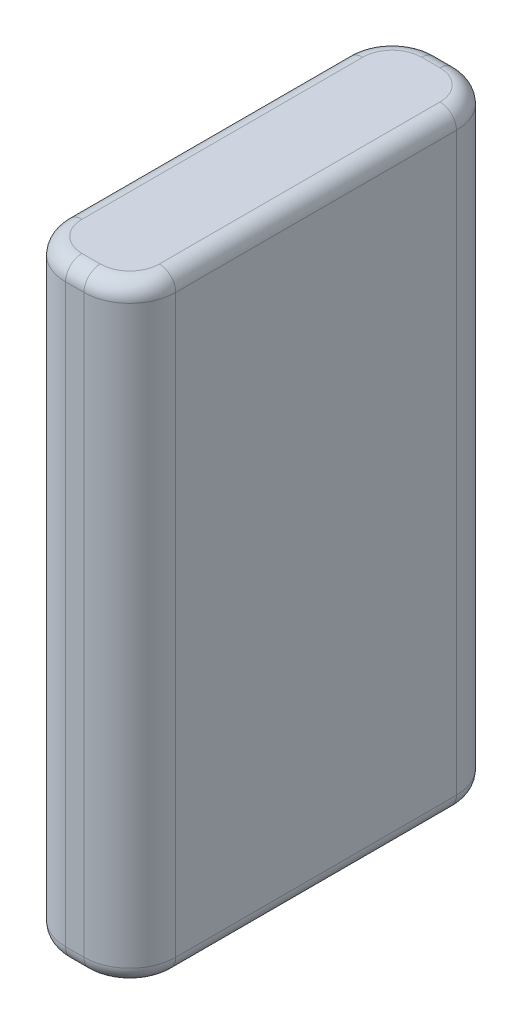
ISO-10303-21;
HEADER;
FILE_DESCRIPTION(('STEP AP214'),'2;1');
FILE_NAME('part.step','',(''),(''),'','','');
FILE_SCHEMA(('AUTOMOTIVE_DESIGN { 1 0 10303 214 1 1 1 1 }'));
ENDSEC;
DATA;
#1=APPLICATION_CONTEXT('core data for automotive mechanical design processes');
#2=APPLICATION_PROTOCOL_DEFINITION('international standard','automotive_design',2000,#1);
#3=PRODUCT_CONTEXT('',#1,'mechanical');
#4=PRODUCT('Part','Part','',(#3));
#5=PRODUCT_RELATED_PRODUCT_CATEGORY('part','',(#4));
#6=PRODUCT_DEFINITION_FORMATION('','',#4);
#7=PRODUCT_DEFINITION_CONTEXT('part definition',#1,'design');
#8=PRODUCT_DEFINITION('design','',#6,#7);
#9=PRODUCT_DEFINITION_SHAPE('','',#8);
#10=(LENGTH_UNIT() NAMED_UNIT(*) SI_UNIT(.MILLI.,.METRE.));
#11=(NAMED_UNIT(*) PLANE_ANGLE_UNIT() SI_UNIT($,.RADIAN.));
#12=(NAMED_UNIT(*) SI_UNIT($,.STERADIAN.) SOLID_ANGLE_UNIT());
#13=UNCERTAINTY_MEASURE_WITH_UNIT(LENGTH_MEASURE(1.E-05),#10,'distance_accuracy_value','');
#14=(GEOMETRIC_REPRESENTATION_CONTEXT(3) GLOBAL_UNCERTAINTY_ASSIGNED_CONTEXT((#13)) GLOBAL_UNIT_ASSIGNED_CONTEXT((#10,
#11,#12)) REPRESENTATION_CONTEXT('',''));
#15=CARTESIAN_POINT('',(0.,0.,0.));
#16=DIRECTION('',(0.,0.,1.));
#17=DIRECTION('',(1.,0.,0.));
#18=AXIS2_PLACEMENT_3D('',#15,#16,#17);
#19=CARTESIAN_POINT('',(4.2,46.4,14.2));
#20=DIRECTION('',(-1.,0.,0.));
#21=DIRECTION('',(0.,0.,1.));
#22=AXIS2_PLACEMENT_3D('',#19,#20,#21);
#23=PLANE('',#22);
#24=DIRECTION('',(0.,-1.,0.));
#25=VECTOR('',#24,1.);
#26=CARTESIAN_POINT('',(4.2,46.4,-10.7));
#27=LINE('',#26,#25);
#28=CARTESIAN_POINT('',(4.2,1.25,-10.7));
#29=VERTEX_POINT('',#28);
#30=CARTESIAN_POINT('',(4.2,45.15,-10.7));
#31=VERTEX_POINT('',#30);
#32=EDGE_CURVE('E285',#29,#31,#27,.F.);
#33=ORIENTED_EDGE('',*,*,#32,.T.);
#34=DIRECTION('',(0.,0.,-1.));
#35=VECTOR('',#34,1.);
#36=CARTESIAN_POINT('',(4.2,45.15,14.2));
#37=LINE('',#36,#35);
#38=CARTESIAN_POINT('',(4.2,45.15,10.7));
#39=VERTEX_POINT('',#38);
#40=EDGE_CURVE('E190',#31,#39,#37,.F.);
#41=ORIENTED_EDGE('',*,*,#40,.T.);
#42=DIRECTION('',(0.,-1.,0.));
#43=VECTOR('',#42,1.);
#44=CARTESIAN_POINT('',(4.2,46.4,10.7));
#45=LINE('',#44,#43);
#46=CARTESIAN_POINT('',(4.2,1.25,10.7));
#47=VERTEX_POINT('',#46);
#48=EDGE_CURVE('E293',#39,#47,#45,.T.);
#49=ORIENTED_EDGE('',*,*,#48,.T.);
#50=DIRECTION('',(0.,0.,-1.));
#51=VECTOR('',#50,1.);
#52=CARTESIAN_POINT('',(4.2,1.25,-10.7));
#53=LINE('',#52,#51);
#54=EDGE_CURVE('E188',#47,#29,#53,.T.);
#55=ORIENTED_EDGE('',*,*,#54,.T.);
#56=EDGE_LOOP('',(#33,#41,#49,#55));
#57=FACE_BOUND('',#56,.T.);
#58=ADVANCED_FACE('F41',(#57),#23,.F.);
#59=CARTESIAN_POINT('',(-4.2,46.4,-14.2));
#60=DIRECTION('',(0.,0.,1.));
#61=DIRECTION('',(1.,0.,0.));
#62=AXIS2_PLACEMENT_3D('',#59,#60,#61);
#63=PLANE('',#62);
#64=DIRECTION('',(0.,-1.,0.));
#65=VECTOR('',#64,1.);
#66=CARTESIAN_POINT('',(-0.700000000000001,46.4,-14.2));
#67=LINE('',#66,#65);
#68=CARTESIAN_POINT('',(-0.700000000000001,1.25,-14.2));
#69=VERTEX_POINT('',#68);
#70=CARTESIAN_POINT('',(-0.700000000000001,45.15,-14.2));
#71=VERTEX_POINT('',#70);
#72=EDGE_CURVE('E290',#69,#71,#67,.F.);
#73=ORIENTED_EDGE('',*,*,#72,.T.);
#74=DIRECTION('',(-1.,0.,0.));
#75=VECTOR('',#74,1.);
#76=CARTESIAN_POINT('',(-4.2,45.15,-14.2));
#77=LINE('',#76,#75);
#78=CARTESIAN_POINT('',(0.700000000000001,45.15,-14.2));
#79=VERTEX_POINT('',#78);
#80=EDGE_CURVE('E215',#71,#79,#77,.F.);
#81=ORIENTED_EDGE('',*,*,#80,.T.);
#82=DIRECTION('',(0.,-1.,0.));
#83=VECTOR('',#82,1.);
#84=CARTESIAN_POINT('',(0.700000000000001,46.4,-14.2));
#85=LINE('',#84,#83);
#86=CARTESIAN_POINT('',(0.700000000000001,1.25,-14.2));
#87=VERTEX_POINT('',#86);
#88=EDGE_CURVE('E283',#79,#87,#85,.T.);
#89=ORIENTED_EDGE('',*,*,#88,.T.);
#90=DIRECTION('',(-1.,0.,0.));
#91=VECTOR('',#90,1.);
#92=CARTESIAN_POINT('',(-0.700000000000001,1.25,-14.2));
#93=LINE('',#92,#91);
#94=EDGE_CURVE('E213',#87,#69,#93,.T.);
#95=ORIENTED_EDGE('',*,*,#94,.T.);
#96=EDGE_LOOP('',(#73,#81,#89,#95));
#97=FACE_BOUND('',#96,.T.);
#98=ADVANCED_FACE('F288',(#97),#63,.F.);
#99=CARTESIAN_POINT('',(-4.2,46.4,14.2));
#100=DIRECTION('',(1.,0.,0.));
#101=DIRECTION('',(0.,0.,-1.));
#102=AXIS2_PLACEMENT_3D('',#99,#100,#101);
#103=PLANE('',#102);
#104=DIRECTION('',(0.,-1.,0.));
#105=VECTOR('',#104,1.);
#106=CARTESIAN_POINT('',(-4.2,46.4,10.7));
#107=LINE('',#106,#105);
#108=CARTESIAN_POINT('',(-4.2,1.25,10.7));
#109=VERTEX_POINT('',#108);
#110=CARTESIAN_POINT('',(-4.2,45.15,10.7));
#111=VERTEX_POINT('',#110);
#112=EDGE_CURVE('E246',#109,#111,#107,.F.);
#113=ORIENTED_EDGE('',*,*,#112,.T.);
#114=DIRECTION('',(0.,0.,1.));
#115=VECTOR('',#114,1.);
#116=CARTESIAN_POINT('',(-4.2,45.15,14.2));
#117=LINE('',#116,#115);
#118=CARTESIAN_POINT('',(-4.2,45.15,-10.7));
#119=VERTEX_POINT('',#118);
#120=EDGE_CURVE('E207',#111,#119,#117,.F.);
#121=ORIENTED_EDGE('',*,*,#120,.T.);
#122=DIRECTION('',(0.,-1.,0.));
#123=VECTOR('',#122,1.);
#124=CARTESIAN_POINT('',(-4.2,46.4,-10.7));
#125=LINE('',#124,#123);
#126=CARTESIAN_POINT('',(-4.2,1.25,-10.7));
#127=VERTEX_POINT('',#126);
#128=EDGE_CURVE('E291',#119,#127,#125,.T.);
#129=ORIENTED_EDGE('',*,*,#128,.T.);
#130=DIRECTION('',(0.,0.,1.));
#131=VECTOR('',#130,1.);
#132=CARTESIAN_POINT('',(-4.2,1.25,10.7));
#133=LINE('',#132,#131);
#134=EDGE_CURVE('E205',#127,#109,#133,.T.);
#135=ORIENTED_EDGE('',*,*,#134,.T.);
#136=EDGE_LOOP('',(#113,#121,#129,#135));
#137=FACE_BOUND('',#136,.T.);
#138=ADVANCED_FACE('F353',(#137),#103,.F.);
#139=CARTESIAN_POINT('',(-4.2,46.4,14.2));
#140=DIRECTION('',(0.,0.,-1.));
#141=DIRECTION('',(-1.,0.,0.));
#142=AXIS2_PLACEMENT_3D('',#139,#140,#141);
#143=PLANE('',#142);
#144=DIRECTION('',(0.,-1.,0.));
#145=VECTOR('',#144,1.);
#146=CARTESIAN_POINT('',(0.700000000000001,46.4,14.2));
#147=LINE('',#146,#145);
#148=CARTESIAN_POINT('',(0.700000000000001,1.25,14.2));
#149=VERTEX_POINT('',#148);
#150=CARTESIAN_POINT('',(0.700000000000001,45.15,14.2));
#151=VERTEX_POINT('',#150);
#152=EDGE_CURVE('E174',#149,#151,#147,.F.);
#153=ORIENTED_EDGE('',*,*,#152,.T.);
#154=DIRECTION('',(1.,0.,0.));
#155=VECTOR('',#154,1.);
#156=CARTESIAN_POINT('',(-4.2,45.15,14.2));
#157=LINE('',#156,#155);
#158=CARTESIAN_POINT('',(-0.700000000000001,45.15,14.2));
#159=VERTEX_POINT('',#158);
#160=EDGE_CURVE('E198',#151,#159,#157,.F.);
#161=ORIENTED_EDGE('',*,*,#160,.T.);
#162=DIRECTION('',(0.,-1.,0.));
#163=VECTOR('',#162,1.);
#164=CARTESIAN_POINT('',(-0.700000000000001,46.4,14.2));
#165=LINE('',#164,#163);
#166=CARTESIAN_POINT('',(-0.700000000000001,1.25,14.2));
#167=VERTEX_POINT('',#166);
#168=EDGE_CURVE('E302',#159,#167,#165,.T.);
#169=ORIENTED_EDGE('',*,*,#168,.T.);
#170=DIRECTION('',(1.,0.,0.));
#171=VECTOR('',#170,1.);
#172=CARTESIAN_POINT('',(0.700000000000001,1.25,14.2));
#173=LINE('',#172,#171);
#174=EDGE_CURVE('E196',#167,#149,#173,.T.);
#175=ORIENTED_EDGE('',*,*,#174,.T.);
#176=EDGE_LOOP('',(#153,#161,#169,#175));
#177=FACE_BOUND('',#176,.T.);
#178=ADVANCED_FACE('F369',(#177),#143,.F.);
#179=CARTESIAN_POINT('',(0.,46.4,0.));
#180=DIRECTION('',(0.,-1.,0.));
#181=DIRECTION('',(0.,0.,-1.));
#182=AXIS2_PLACEMENT_3D('',#179,#180,#181);
#183=PLANE('',#182);
#184=DIRECTION('',(0.,0.,-1.));
#185=VECTOR('',#184,1.);
#186=CARTESIAN_POINT('',(2.95,46.4,0.));
#187=LINE('',#186,#185);
#188=CARTESIAN_POINT('',(2.95,46.4,10.7));
#189=VERTEX_POINT('',#188);
#190=CARTESIAN_POINT('',(2.95,46.4,-10.7));
#191=VERTEX_POINT('',#190);
#192=EDGE_CURVE('E178',#189,#191,#187,.T.);
#193=ORIENTED_EDGE('',*,*,#192,.T.);
#194=CARTESIAN_POINT('',(0.700000000000001,46.4,-10.7));
#195=DIRECTION('',(0.,-1.,0.));
#196=DIRECTION('',(0.,0.,-1.));
#197=AXIS2_PLACEMENT_3D('',#194,#195,#196);
#198=CIRCLE('',#197,2.25);
#199=CARTESIAN_POINT('',(0.700000000000001,46.4,-12.95));
#200=VERTEX_POINT('',#199);
#201=EDGE_CURVE('E159',#191,#200,#198,.F.);
#202=ORIENTED_EDGE('',*,*,#201,.T.);
#203=DIRECTION('',(-1.,0.,0.));
#204=VECTOR('',#203,1.);
#205=CARTESIAN_POINT('',(0.,46.4,-12.95));
#206=LINE('',#205,#204);
#207=CARTESIAN_POINT('',(-0.700000000000001,46.4,-12.95));
#208=VERTEX_POINT('',#207);
#209=EDGE_CURVE('E167',#200,#208,#206,.T.);
#210=ORIENTED_EDGE('',*,*,#209,.T.);
#211=CARTESIAN_POINT('',(-0.700000000000001,46.4,-10.7));
#212=DIRECTION('',(0.,-1.,0.));
#213=DIRECTION('',(0.,0.,-1.));
#214=AXIS2_PLACEMENT_3D('',#211,#212,#213);
#215=CIRCLE('',#214,2.25);
#216=CARTESIAN_POINT('',(-2.95,46.4,-10.7));
#217=VERTEX_POINT('',#216);
#218=EDGE_CURVE('E173',#208,#217,#215,.F.);
#219=ORIENTED_EDGE('',*,*,#218,.T.);
#220=DIRECTION('',(0.,0.,1.));
#221=VECTOR('',#220,1.);
#222=CARTESIAN_POINT('',(-2.95,46.4,0.));
#223=LINE('',#222,#221);
#224=CARTESIAN_POINT('',(-2.95,46.4,10.7));
#225=VERTEX_POINT('',#224);
#226=EDGE_CURVE('E308',#217,#225,#223,.T.);
#227=ORIENTED_EDGE('',*,*,#226,.T.);
#228=CARTESIAN_POINT('',(-0.700000000000001,46.4,10.7));
#229=DIRECTION('',(0.,-1.,0.));
#230=DIRECTION('',(0.,0.,-1.));
#231=AXIS2_PLACEMENT_3D('',#228,#229,#230);
#232=CIRCLE('',#231,2.25);
#233=CARTESIAN_POINT('',(-0.700000000000001,46.4,12.95));
#234=VERTEX_POINT('',#233);
#235=EDGE_CURVE('E310',#225,#234,#232,.F.);
#236=ORIENTED_EDGE('',*,*,#235,.T.);
#237=DIRECTION('',(1.,0.,0.));
#238=VECTOR('',#237,1.);
#239=CARTESIAN_POINT('',(0.,46.4,12.95));
#240=LINE('',#239,#238);
#241=CARTESIAN_POINT('',(0.700000000000001,46.4,12.95));
#242=VERTEX_POINT('',#241);
#243=EDGE_CURVE('E312',#234,#242,#240,.T.);
#244=ORIENTED_EDGE('',*,*,#243,.T.);
#245=CARTESIAN_POINT('',(0.700000000000001,46.4,10.7));
#246=DIRECTION('',(0.,-1.,0.));
#247=DIRECTION('',(0.,0.,-1.));
#248=AXIS2_PLACEMENT_3D('',#245,#246,#247);
#249=CIRCLE('',#248,2.25);
#250=EDGE_CURVE('E183',#242,#189,#249,.F.);
#251=ORIENTED_EDGE('',*,*,#250,.T.);
#252=EDGE_LOOP('',(#193,#202,#210,#219,#227,#236,#244,#251));
#253=FACE_BOUND('',#252,.T.);
#254=ADVANCED_FACE('F176',(#253),#183,.F.);
#255=CARTESIAN_POINT('',(0.,0.,0.));
#256=DIRECTION('',(0.,-1.,0.));
#257=DIRECTION('',(0.,0.,-1.));
#258=AXIS2_PLACEMENT_3D('',#255,#256,#257);
#259=PLANE('',#258);
#260=DIRECTION('',(1.,0.,0.));
#261=VECTOR('',#260,1.);
#262=CARTESIAN_POINT('',(-0.700000000000001,0.,12.95));
#263=LINE('',#262,#261);
#264=CARTESIAN_POINT('',(0.700000000000001,0.,12.95));
#265=VERTEX_POINT('',#264);
#266=CARTESIAN_POINT('',(-0.700000000000001,0.,12.95));
#267=VERTEX_POINT('',#266);
#268=EDGE_CURVE('E50',#265,#267,#263,.F.);
#269=ORIENTED_EDGE('',*,*,#268,.T.);
#270=CARTESIAN_POINT('',(-0.700000000000001,0.,10.7));
#271=DIRECTION('',(0.,-1.,0.));
#272=DIRECTION('',(0.,0.,-1.));
#273=AXIS2_PLACEMENT_3D('',#270,#271,#272);
#274=CIRCLE('',#273,2.25);
#275=CARTESIAN_POINT('',(-2.95,0.,10.7));
#276=VERTEX_POINT('',#275);
#277=EDGE_CURVE('E11',#267,#276,#274,.T.);
#278=ORIENTED_EDGE('',*,*,#277,.T.);
#279=DIRECTION('',(0.,0.,1.));
#280=VECTOR('',#279,1.);
#281=CARTESIAN_POINT('',(-2.95,0.,-10.7));
#282=LINE('',#281,#280);
#283=CARTESIAN_POINT('',(-2.95,0.,-10.7));
#284=VERTEX_POINT('',#283);
#285=EDGE_CURVE('E217',#276,#284,#282,.F.);
#286=ORIENTED_EDGE('',*,*,#285,.T.);
#287=CARTESIAN_POINT('',(-0.700000000000001,0.,-10.7));
#288=DIRECTION('',(0.,-1.,0.));
#289=DIRECTION('',(0.,0.,-1.));
#290=AXIS2_PLACEMENT_3D('',#287,#288,#289);
#291=CIRCLE('',#290,2.25);
#292=CARTESIAN_POINT('',(-0.700000000000001,0.,-12.95));
#293=VERTEX_POINT('',#292);
#294=EDGE_CURVE('E219',#284,#293,#291,.T.);
#295=ORIENTED_EDGE('',*,*,#294,.T.);
#296=DIRECTION('',(-1.,0.,0.));
#297=VECTOR('',#296,1.);
#298=CARTESIAN_POINT('',(0.700000000000001,0.,-12.95));
#299=LINE('',#298,#297);
#300=CARTESIAN_POINT('',(0.700000000000001,0.,-12.95));
#301=VERTEX_POINT('',#300);
#302=EDGE_CURVE('E221',#293,#301,#299,.F.);
#303=ORIENTED_EDGE('',*,*,#302,.T.);
#304=CARTESIAN_POINT('',(0.700000000000001,0.,-10.7));
#305=DIRECTION('',(0.,-1.,0.));
#306=DIRECTION('',(0.,0.,-1.));
#307=AXIS2_PLACEMENT_3D('',#304,#305,#306);
#308=CIRCLE('',#307,2.25);
#309=CARTESIAN_POINT('',(2.95,0.,-10.7));
#310=VERTEX_POINT('',#309);
#311=EDGE_CURVE('E223',#301,#310,#308,.T.);
#312=ORIENTED_EDGE('',*,*,#311,.T.);
#313=DIRECTION('',(0.,0.,-1.));
#314=VECTOR('',#313,1.);
#315=CARTESIAN_POINT('',(2.95,0.,10.7));
#316=LINE('',#315,#314);
#317=CARTESIAN_POINT('',(2.95,0.,10.7));
#318=VERTEX_POINT('',#317);
#319=EDGE_CURVE('E225',#310,#318,#316,.F.);
#320=ORIENTED_EDGE('',*,*,#319,.T.);
#321=CARTESIAN_POINT('',(0.700000000000001,0.,10.7));
#322=DIRECTION('',(0.,-1.,0.));
#323=DIRECTION('',(0.,0.,-1.));
#324=AXIS2_PLACEMENT_3D('',#321,#322,#323);
#325=CIRCLE('',#324,2.25);
#326=EDGE_CURVE('E61',#318,#265,#325,.T.);
#327=ORIENTED_EDGE('',*,*,#326,.T.);
#328=EDGE_LOOP('',(#269,#278,#286,#295,#303,#312,#320,#327));
#329=FACE_BOUND('',#328,.T.);
#330=ADVANCED_FACE('F340',(#329),#259,.T.);
#331=CARTESIAN_POINT('',(-0.700000000000001,46.4,-10.7));
#332=DIRECTION('',(0.,-1.,0.));
#333=DIRECTION('',(0.,0.,-1.));
#334=AXIS2_PLACEMENT_3D('',#331,#332,#333);
#335=CYLINDRICAL_SURFACE('',#334,3.5);
#336=ORIENTED_EDGE('',*,*,#128,.F.);
#337=CARTESIAN_POINT('',(-0.700000000000001,45.15,-10.7));
#338=DIRECTION('',(0.,-1.,0.));
#339=DIRECTION('',(0.,0.,-1.));
#340=AXIS2_PLACEMENT_3D('',#337,#338,#339);
#341=CIRCLE('',#340,3.5);
#342=EDGE_CURVE('E211',#119,#71,#341,.T.);
#343=ORIENTED_EDGE('',*,*,#342,.T.);
#344=ORIENTED_EDGE('',*,*,#72,.F.);
#345=CARTESIAN_POINT('',(-0.700000000000001,1.25,-10.7));
#346=DIRECTION('',(0.,-1.,0.));
#347=DIRECTION('',(0.,0.,-1.));
#348=AXIS2_PLACEMENT_3D('',#345,#346,#347);
#349=CIRCLE('',#348,3.5);
#350=EDGE_CURVE('E209',#69,#127,#349,.F.);
#351=ORIENTED_EDGE('',*,*,#350,.T.);
#352=EDGE_LOOP('',(#336,#343,#344,#351));
#353=FACE_BOUND('',#352,.T.);
#354=ADVANCED_FACE('F386',(#353),#335,.T.);
#355=CARTESIAN_POINT('',(0.700000000000001,46.4,-10.7));
#356=DIRECTION('',(0.,-1.,0.));
#357=DIRECTION('',(0.,0.,-1.));
#358=AXIS2_PLACEMENT_3D('',#355,#356,#357);
#359=CYLINDRICAL_SURFACE('',#358,3.5);
#360=ORIENTED_EDGE('',*,*,#88,.F.);
#361=CARTESIAN_POINT('',(0.700000000000001,45.15,-10.7));
#362=DIRECTION('',(0.,-1.,0.));
#363=DIRECTION('',(0.,0.,-1.));
#364=AXIS2_PLACEMENT_3D('',#361,#362,#363);
#365=CIRCLE('',#364,3.5);
#366=EDGE_CURVE('E161',#79,#31,#365,.T.);
#367=ORIENTED_EDGE('',*,*,#366,.T.);
#368=ORIENTED_EDGE('',*,*,#32,.F.);
#369=CARTESIAN_POINT('',(0.700000000000001,1.25,-10.7));
#370=DIRECTION('',(0.,-1.,0.));
#371=DIRECTION('',(0.,0.,-1.));
#372=AXIS2_PLACEMENT_3D('',#369,#370,#371);
#373=CIRCLE('',#372,3.5);
#374=EDGE_CURVE('E180',#29,#87,#373,.F.);
#375=ORIENTED_EDGE('',*,*,#374,.T.);
#376=EDGE_LOOP('',(#360,#367,#368,#375));
#377=FACE_BOUND('',#376,.T.);
#378=ADVANCED_FACE('F282',(#377),#359,.T.);
#379=CARTESIAN_POINT('',(0.700000000000001,46.4,10.7));
#380=DIRECTION('',(0.,-1.,0.));
#381=DIRECTION('',(0.,0.,-1.));
#382=AXIS2_PLACEMENT_3D('',#379,#380,#381);
#383=CYLINDRICAL_SURFACE('',#382,3.5);
#384=ORIENTED_EDGE('',*,*,#48,.F.);
#385=CARTESIAN_POINT('',(0.700000000000001,45.15,10.7));
#386=DIRECTION('',(0.,-1.,0.));
#387=DIRECTION('',(0.,0.,-1.));
#388=AXIS2_PLACEMENT_3D('',#385,#386,#387);
#389=CIRCLE('',#388,3.5);
#390=EDGE_CURVE('E194',#39,#151,#389,.T.);
#391=ORIENTED_EDGE('',*,*,#390,.T.);
#392=ORIENTED_EDGE('',*,*,#152,.F.);
#393=CARTESIAN_POINT('',(0.700000000000001,1.25,10.7));
#394=DIRECTION('',(0.,-1.,0.));
#395=DIRECTION('',(0.,0.,-1.));
#396=AXIS2_PLACEMENT_3D('',#393,#394,#395);
#397=CIRCLE('',#396,3.5);
#398=EDGE_CURVE('E192',#149,#47,#397,.F.);
#399=ORIENTED_EDGE('',*,*,#398,.T.);
#400=EDGE_LOOP('',(#384,#391,#392,#399));
#401=FACE_BOUND('',#400,.T.);
#402=ADVANCED_FACE('F326',(#401),#383,.T.);
#403=CARTESIAN_POINT('',(-0.700000000000001,46.4,10.7));
#404=DIRECTION('',(0.,-1.,0.));
#405=DIRECTION('',(0.,0.,-1.));
#406=AXIS2_PLACEMENT_3D('',#403,#404,#405);
#407=CYLINDRICAL_SURFACE('',#406,3.5);
#408=ORIENTED_EDGE('',*,*,#168,.F.);
#409=CARTESIAN_POINT('',(-0.700000000000001,45.15,10.7));
#410=DIRECTION('',(0.,-1.,0.));
#411=DIRECTION('',(0.,0.,-1.));
#412=AXIS2_PLACEMENT_3D('',#409,#410,#411);
#413=CIRCLE('',#412,3.5);
#414=EDGE_CURVE('E203',#159,#111,#413,.T.);
#415=ORIENTED_EDGE('',*,*,#414,.T.);
#416=ORIENTED_EDGE('',*,*,#112,.F.);
#417=CARTESIAN_POINT('',(-0.700000000000001,1.25,10.7));
#418=DIRECTION('',(0.,-1.,0.));
#419=DIRECTION('',(0.,0.,-1.));
#420=AXIS2_PLACEMENT_3D('',#417,#418,#419);
#421=CIRCLE('',#420,3.5);
#422=EDGE_CURVE('E200',#109,#167,#421,.F.);
#423=ORIENTED_EDGE('',*,*,#422,.T.);
#424=EDGE_LOOP('',(#408,#415,#416,#423));
#425=FACE_BOUND('',#424,.T.);
#426=ADVANCED_FACE('F358',(#425),#407,.T.);
#427=CARTESIAN_POINT('',(-0.700000000000001,45.15,10.7));
#428=DIRECTION('',(0.,-1.,0.));
#429=DIRECTION('',(0.,0.,-1.));
#430=AXIS2_PLACEMENT_3D('',#427,#428,#429);
#431=TOROIDAL_SURFACE('',#430,2.25,1.25);
#432=CARTESIAN_POINT('',(-2.95,45.15,10.7));
#433=DIRECTION('',(0.,0.,-1.));
#434=DIRECTION('',(-1.,0.,0.));
#435=AXIS2_PLACEMENT_3D('',#432,#433,#434);
#436=CIRCLE('',#435,1.25);
#437=EDGE_CURVE('E240',#111,#225,#436,.T.);
#438=ORIENTED_EDGE('',*,*,#437,.F.);
#439=ORIENTED_EDGE('',*,*,#414,.F.);
#440=CARTESIAN_POINT('',(-0.700000000000001,45.15,12.95));
#441=DIRECTION('',(1.,0.,0.));
#442=DIRECTION('',(0.,0.,-1.));
#443=AXIS2_PLACEMENT_3D('',#440,#441,#442);
#444=CIRCLE('',#443,1.25);
#445=EDGE_CURVE('E243',#234,#159,#444,.T.);
#446=ORIENTED_EDGE('',*,*,#445,.F.);
#447=ORIENTED_EDGE('',*,*,#235,.F.);
#448=EDGE_LOOP('',(#438,#439,#446,#447));
#449=FACE_BOUND('',#448,.T.);
#450=ADVANCED_FACE('F362',(#449),#431,.T.);
#451=CARTESIAN_POINT('',(0.,45.15,12.95));
#452=DIRECTION('',(1.,0.,0.));
#453=DIRECTION('',(0.,0.,-1.));
#454=AXIS2_PLACEMENT_3D('',#451,#452,#453);
#455=CYLINDRICAL_SURFACE('',#454,1.25);
#456=ORIENTED_EDGE('',*,*,#445,.T.);
#457=ORIENTED_EDGE('',*,*,#160,.F.);
#458=CARTESIAN_POINT('',(0.700000000000001,45.15,12.95));
#459=DIRECTION('',(1.,0.,0.));
#460=DIRECTION('',(0.,0.,-1.));
#461=AXIS2_PLACEMENT_3D('',#458,#459,#460);
#462=CIRCLE('',#461,1.25);
#463=EDGE_CURVE('E237',#242,#151,#462,.T.);
#464=ORIENTED_EDGE('',*,*,#463,.F.);
#465=ORIENTED_EDGE('',*,*,#243,.F.);
#466=EDGE_LOOP('',(#456,#457,#464,#465));
#467=FACE_BOUND('',#466,.T.);
#468=ADVANCED_FACE('F367',(#467),#455,.T.);
#469=CARTESIAN_POINT('',(-2.95,45.15,0.));
#470=DIRECTION('',(0.,0.,1.));
#471=DIRECTION('',(1.,0.,0.));
#472=AXIS2_PLACEMENT_3D('',#469,#470,#471);
#473=CYLINDRICAL_SURFACE('',#472,1.25);
#474=ORIENTED_EDGE('',*,*,#437,.T.);
#475=ORIENTED_EDGE('',*,*,#226,.F.);
#476=CARTESIAN_POINT('',(-2.95,45.15,-10.7));
#477=DIRECTION('',(0.,0.,-1.));
#478=DIRECTION('',(-1.,0.,0.));
#479=AXIS2_PLACEMENT_3D('',#476,#477,#478);
#480=CIRCLE('',#479,1.25);
#481=EDGE_CURVE('E234',#119,#217,#480,.T.);
#482=ORIENTED_EDGE('',*,*,#481,.F.);
#483=ORIENTED_EDGE('',*,*,#120,.F.);
#484=EDGE_LOOP('',(#474,#475,#482,#483));
#485=FACE_BOUND('',#484,.T.);
#486=ADVANCED_FACE('F408',(#485),#473,.T.);
#487=CARTESIAN_POINT('',(0.700000000000001,45.15,10.7));
#488=DIRECTION('',(0.,-1.,0.));
#489=DIRECTION('',(0.,0.,-1.));
#490=AXIS2_PLACEMENT_3D('',#487,#488,#489);
#491=TOROIDAL_SURFACE('',#490,2.25,1.25);
#492=ORIENTED_EDGE('',*,*,#463,.T.);
#493=ORIENTED_EDGE('',*,*,#390,.F.);
#494=CARTESIAN_POINT('',(2.95,45.15,10.7));
#495=DIRECTION('',(0.,0.,-1.));
#496=DIRECTION('',(-1.,0.,0.));
#497=AXIS2_PLACEMENT_3D('',#494,#495,#496);
#498=CIRCLE('',#497,1.25);
#499=EDGE_CURVE('E231',#189,#39,#498,.T.);
#500=ORIENTED_EDGE('',*,*,#499,.F.);
#501=ORIENTED_EDGE('',*,*,#250,.F.);
#502=EDGE_LOOP('',(#492,#493,#500,#501));
#503=FACE_BOUND('',#502,.T.);
#504=ADVANCED_FACE('F319',(#503),#491,.T.);
#505=CARTESIAN_POINT('',(-0.700000000000001,45.15,-10.7));
#506=DIRECTION('',(0.,-1.,0.));
#507=DIRECTION('',(0.,0.,-1.));
#508=AXIS2_PLACEMENT_3D('',#505,#506,#507);
#509=TOROIDAL_SURFACE('',#508,2.25,1.25);
#510=ORIENTED_EDGE('',*,*,#481,.T.);
#511=ORIENTED_EDGE('',*,*,#218,.F.);
#512=CARTESIAN_POINT('',(-0.700000000000001,45.15,-12.95));
#513=DIRECTION('',(1.,0.,0.));
#514=DIRECTION('',(0.,0.,-1.));
#515=AXIS2_PLACEMENT_3D('',#512,#513,#514);
#516=CIRCLE('',#515,1.25);
#517=EDGE_CURVE('E170',#71,#208,#516,.T.);
#518=ORIENTED_EDGE('',*,*,#517,.F.);
#519=ORIENTED_EDGE('',*,*,#342,.F.);
#520=EDGE_LOOP('',(#510,#511,#518,#519));
#521=FACE_BOUND('',#520,.T.);
#522=ADVANCED_FACE('F402',(#521),#509,.T.);
#523=CARTESIAN_POINT('',(2.95,45.15,0.));
#524=DIRECTION('',(0.,0.,-1.));
#525=DIRECTION('',(-1.,0.,0.));
#526=AXIS2_PLACEMENT_3D('',#523,#524,#525);
#527=CYLINDRICAL_SURFACE('',#526,1.25);
#528=ORIENTED_EDGE('',*,*,#499,.T.);
#529=ORIENTED_EDGE('',*,*,#40,.F.);
#530=CARTESIAN_POINT('',(2.95,45.15,-10.7));
#531=DIRECTION('',(0.,0.,-1.));
#532=DIRECTION('',(-1.,0.,0.));
#533=AXIS2_PLACEMENT_3D('',#530,#531,#532);
#534=CIRCLE('',#533,1.25);
#535=EDGE_CURVE('E164',#191,#31,#534,.T.);
#536=ORIENTED_EDGE('',*,*,#535,.F.);
#537=ORIENTED_EDGE('',*,*,#192,.F.);
#538=EDGE_LOOP('',(#528,#529,#536,#537));
#539=FACE_BOUND('',#538,.T.);
#540=ADVANCED_FACE('F322',(#539),#527,.T.);
#541=CARTESIAN_POINT('',(0.,45.15,-12.95));
#542=DIRECTION('',(-1.,0.,0.));
#543=DIRECTION('',(0.,0.,1.));
#544=AXIS2_PLACEMENT_3D('',#541,#542,#543);
#545=CYLINDRICAL_SURFACE('',#544,1.25);
#546=ORIENTED_EDGE('',*,*,#517,.T.);
#547=ORIENTED_EDGE('',*,*,#209,.F.);
#548=CARTESIAN_POINT('',(0.700000000000001,45.15,-12.95));
#549=DIRECTION('',(1.,0.,0.));
#550=DIRECTION('',(0.,0.,-1.));
#551=AXIS2_PLACEMENT_3D('',#548,#549,#550);
#552=CIRCLE('',#551,1.25);
#553=EDGE_CURVE('E155',#79,#200,#552,.T.);
#554=ORIENTED_EDGE('',*,*,#553,.F.);
#555=ORIENTED_EDGE('',*,*,#80,.F.);
#556=EDGE_LOOP('',(#546,#547,#554,#555));
#557=FACE_BOUND('',#556,.T.);
#558=ADVANCED_FACE('F168',(#557),#545,.T.);
#559=CARTESIAN_POINT('',(0.700000000000001,45.15,-10.7));
#560=DIRECTION('',(0.,-1.,0.));
#561=DIRECTION('',(0.,0.,-1.));
#562=AXIS2_PLACEMENT_3D('',#559,#560,#561);
#563=TOROIDAL_SURFACE('',#562,2.25,1.25);
#564=ORIENTED_EDGE('',*,*,#535,.T.);
#565=ORIENTED_EDGE('',*,*,#366,.F.);
#566=ORIENTED_EDGE('',*,*,#553,.T.);
#567=ORIENTED_EDGE('',*,*,#201,.F.);
#568=EDGE_LOOP('',(#564,#565,#566,#567));
#569=FACE_BOUND('',#568,.T.);
#570=ADVANCED_FACE('F157',(#569),#563,.T.);
#571=CARTESIAN_POINT('',(0.700000000000001,1.25,-10.7));
#572=DIRECTION('',(0.,-1.,0.));
#573=DIRECTION('',(0.,0.,-1.));
#574=AXIS2_PLACEMENT_3D('',#571,#572,#573);
#575=TOROIDAL_SURFACE('',#574,2.25,1.25);
#576=CARTESIAN_POINT('',(0.700000000000001,1.25,-12.95));
#577=DIRECTION('',(-1.,0.,0.));
#578=DIRECTION('',(0.,0.,1.));
#579=AXIS2_PLACEMENT_3D('',#576,#577,#578);
#580=CIRCLE('',#579,1.25);
#581=EDGE_CURVE('E262',#87,#301,#580,.T.);
#582=ORIENTED_EDGE('',*,*,#581,.F.);
#583=ORIENTED_EDGE('',*,*,#374,.F.);
#584=CARTESIAN_POINT('',(2.95,1.25,-10.7));
#585=DIRECTION('',(0.,0.,1.));
#586=DIRECTION('',(1.,0.,0.));
#587=AXIS2_PLACEMENT_3D('',#584,#585,#586);
#588=CIRCLE('',#587,1.25);
#589=EDGE_CURVE('E45',#310,#29,#588,.T.);
#590=ORIENTED_EDGE('',*,*,#589,.F.);
#591=ORIENTED_EDGE('',*,*,#311,.F.);
#592=EDGE_LOOP('',(#582,#583,#590,#591));
#593=FACE_BOUND('',#592,.T.);
#594=ADVANCED_FACE('F43',(#593),#575,.T.);
#595=CARTESIAN_POINT('',(2.95,1.25,14.2));
#596=DIRECTION('',(0.,0.,1.));
#597=DIRECTION('',(1.,0.,0.));
#598=AXIS2_PLACEMENT_3D('',#595,#596,#597);
#599=CYLINDRICAL_SURFACE('',#598,1.25);
#600=ORIENTED_EDGE('',*,*,#589,.T.);
#601=ORIENTED_EDGE('',*,*,#54,.F.);
#602=CARTESIAN_POINT('',(2.95,1.25,10.7));
#603=DIRECTION('',(0.,0.,1.));
#604=DIRECTION('',(1.,0.,0.));
#605=AXIS2_PLACEMENT_3D('',#602,#603,#604);
#606=CIRCLE('',#605,1.25);
#607=EDGE_CURVE('E260',#318,#47,#606,.T.);
#608=ORIENTED_EDGE('',*,*,#607,.F.);
#609=ORIENTED_EDGE('',*,*,#319,.F.);
#610=EDGE_LOOP('',(#600,#601,#608,#609));
#611=FACE_BOUND('',#610,.T.);
#612=ADVANCED_FACE('F273',(#611),#599,.T.);
#613=CARTESIAN_POINT('',(-4.2,1.25,-12.95));
#614=DIRECTION('',(1.,0.,0.));
#615=DIRECTION('',(0.,0.,-1.));
#616=AXIS2_PLACEMENT_3D('',#613,#614,#615);
#617=CYLINDRICAL_SURFACE('',#616,1.25);
#618=ORIENTED_EDGE('',*,*,#581,.T.);
#619=ORIENTED_EDGE('',*,*,#302,.F.);
#620=CARTESIAN_POINT('',(-0.700000000000001,1.25,-12.95));
#621=DIRECTION('',(-1.,0.,0.));
#622=DIRECTION('',(0.,0.,1.));
#623=AXIS2_PLACEMENT_3D('',#620,#621,#622);
#624=CIRCLE('',#623,1.25);
#625=EDGE_CURVE('E257',#69,#293,#624,.T.);
#626=ORIENTED_EDGE('',*,*,#625,.F.);
#627=ORIENTED_EDGE('',*,*,#94,.F.);
#628=EDGE_LOOP('',(#618,#619,#626,#627));
#629=FACE_BOUND('',#628,.T.);
#630=ADVANCED_FACE('F426',(#629),#617,.T.);
#631=CARTESIAN_POINT('',(0.700000000000001,1.25,10.7));
#632=DIRECTION('',(0.,-1.,0.));
#633=DIRECTION('',(0.,0.,-1.));
#634=AXIS2_PLACEMENT_3D('',#631,#632,#633);
#635=TOROIDAL_SURFACE('',#634,2.25,1.25);
#636=ORIENTED_EDGE('',*,*,#607,.T.);
#637=ORIENTED_EDGE('',*,*,#398,.F.);
#638=CARTESIAN_POINT('',(0.700000000000001,1.25,12.95));
#639=DIRECTION('',(-1.,0.,0.));
#640=DIRECTION('',(0.,0.,1.));
#641=AXIS2_PLACEMENT_3D('',#638,#639,#640);
#642=CIRCLE('',#641,1.25);
#643=EDGE_CURVE('E254',#265,#149,#642,.T.);
#644=ORIENTED_EDGE('',*,*,#643,.F.);
#645=ORIENTED_EDGE('',*,*,#326,.F.);
#646=EDGE_LOOP('',(#636,#637,#644,#645));
#647=FACE_BOUND('',#646,.T.);
#648=ADVANCED_FACE('F330',(#647),#635,.T.);
#649=CARTESIAN_POINT('',(-0.700000000000001,1.25,-10.7));
#650=DIRECTION('',(0.,-1.,0.));
#651=DIRECTION('',(0.,0.,-1.));
#652=AXIS2_PLACEMENT_3D('',#649,#650,#651);
#653=TOROIDAL_SURFACE('',#652,2.25,1.25);
#654=ORIENTED_EDGE('',*,*,#625,.T.);
#655=ORIENTED_EDGE('',*,*,#294,.F.);
#656=CARTESIAN_POINT('',(-2.95,1.25,-10.7));
#657=DIRECTION('',(0.,0.,1.));
#658=DIRECTION('',(1.,0.,0.));
#659=AXIS2_PLACEMENT_3D('',#656,#657,#658);
#660=CIRCLE('',#659,1.25);
#661=EDGE_CURVE('E251',#127,#284,#660,.T.);
#662=ORIENTED_EDGE('',*,*,#661,.F.);
#663=ORIENTED_EDGE('',*,*,#350,.F.);
#664=EDGE_LOOP('',(#654,#655,#662,#663));
#665=FACE_BOUND('',#664,.T.);
#666=ADVANCED_FACE('F345',(#665),#653,.T.);
#667=CARTESIAN_POINT('',(-4.2,1.25,12.95));
#668=DIRECTION('',(-1.,0.,0.));
#669=DIRECTION('',(0.,0.,1.));
#670=AXIS2_PLACEMENT_3D('',#667,#668,#669);
#671=CYLINDRICAL_SURFACE('',#670,1.25);
#672=ORIENTED_EDGE('',*,*,#643,.T.);
#673=ORIENTED_EDGE('',*,*,#174,.F.);
#674=CARTESIAN_POINT('',(-0.700000000000001,1.25,12.95));
#675=DIRECTION('',(-1.,0.,0.));
#676=DIRECTION('',(0.,0.,1.));
#677=AXIS2_PLACEMENT_3D('',#674,#675,#676);
#678=CIRCLE('',#677,1.25);
#679=EDGE_CURVE('E249',#267,#167,#678,.T.);
#680=ORIENTED_EDGE('',*,*,#679,.F.);
#681=ORIENTED_EDGE('',*,*,#268,.F.);
#682=EDGE_LOOP('',(#672,#673,#680,#681));
#683=FACE_BOUND('',#682,.T.);
#684=ADVANCED_FACE('F333',(#683),#671,.T.);
#685=CARTESIAN_POINT('',(-2.95,1.25,14.2));
#686=DIRECTION('',(0.,0.,-1.));
#687=DIRECTION('',(-1.,0.,0.));
#688=AXIS2_PLACEMENT_3D('',#685,#686,#687);
#689=CYLINDRICAL_SURFACE('',#688,1.25);
#690=ORIENTED_EDGE('',*,*,#661,.T.);
#691=ORIENTED_EDGE('',*,*,#285,.F.);
#692=CARTESIAN_POINT('',(-2.95,1.25,10.7));
#693=DIRECTION('',(0.,0.,1.));
#694=DIRECTION('',(1.,0.,0.));
#695=AXIS2_PLACEMENT_3D('',#692,#693,#694);
#696=CIRCLE('',#695,1.25);
#697=EDGE_CURVE('E247',#109,#276,#696,.T.);
#698=ORIENTED_EDGE('',*,*,#697,.F.);
#699=ORIENTED_EDGE('',*,*,#134,.F.);
#700=EDGE_LOOP('',(#690,#691,#698,#699));
#701=FACE_BOUND('',#700,.T.);
#702=ADVANCED_FACE('F349',(#701),#689,.T.);
#703=CARTESIAN_POINT('',(-0.700000000000001,1.25,10.7));
#704=DIRECTION('',(0.,-1.,0.));
#705=DIRECTION('',(0.,0.,-1.));
#706=AXIS2_PLACEMENT_3D('',#703,#704,#705);
#707=TOROIDAL_SURFACE('',#706,2.25,1.25);
#708=ORIENTED_EDGE('',*,*,#679,.T.);
#709=ORIENTED_EDGE('',*,*,#422,.F.);
#710=ORIENTED_EDGE('',*,*,#697,.T.);
#711=ORIENTED_EDGE('',*,*,#277,.F.);
#712=EDGE_LOOP('',(#708,#709,#710,#711));
#713=FACE_BOUND('',#712,.T.);
#714=ADVANCED_FACE('F337',(#713),#707,.T.);
#715=CLOSED_SHELL('',(#58,#98,#138,#178,#254,#330,#354,#378,#402,#426,#450,#468,#486,#504,#522,
#540,#558,#570,#594,#612,#630,#648,#666,#684,#702,#714));
#716=MANIFOLD_SOLID_BREP('B2',#715);
#717=ADVANCED_BREP_SHAPE_REPRESENTATION('',(#18,#716),#14);
#718=SHAPE_DEFINITION_REPRESENTATION(#9,#717);
ENDSEC;
END-ISO-10303-21;
